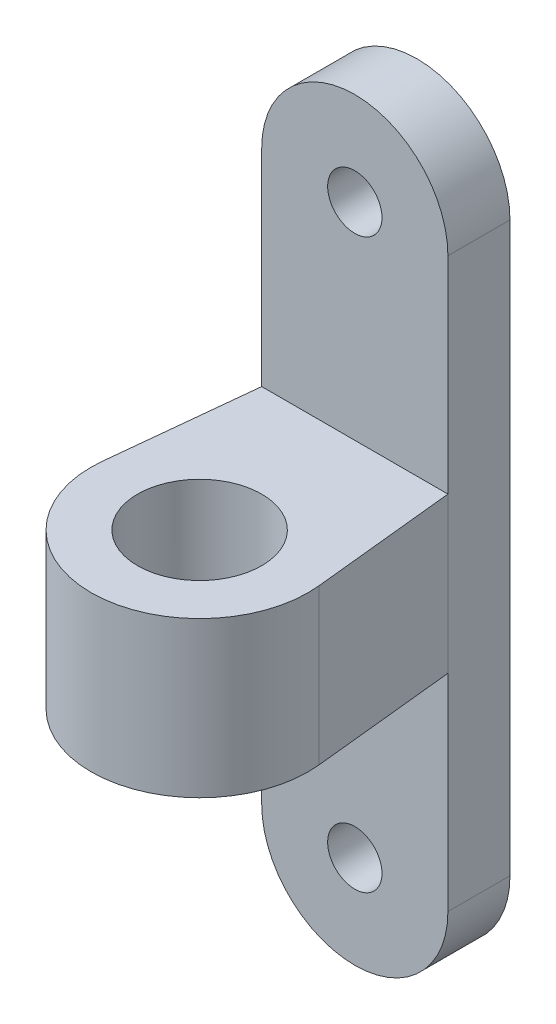
ISO-10303-21;
HEADER;
FILE_DESCRIPTION(('STEP AP214'),'2;1');
FILE_NAME('part.step','',(''),(''),'','','');
FILE_SCHEMA(('AUTOMOTIVE_DESIGN { 1 0 10303 214 1 1 1 1 }'));
ENDSEC;
DATA;
#1=APPLICATION_CONTEXT('core data for automotive mechanical design processes');
#2=APPLICATION_PROTOCOL_DEFINITION('international standard','automotive_design',2000,#1);
#3=PRODUCT_CONTEXT('',#1,'mechanical');
#4=PRODUCT('Part','Part','',(#3));
#5=PRODUCT_RELATED_PRODUCT_CATEGORY('part','',(#4));
#6=PRODUCT_DEFINITION_FORMATION('','',#4);
#7=PRODUCT_DEFINITION_CONTEXT('part definition',#1,'design');
#8=PRODUCT_DEFINITION('design','',#6,#7);
#9=PRODUCT_DEFINITION_SHAPE('','',#8);
#10=(LENGTH_UNIT() NAMED_UNIT(*) SI_UNIT(.MILLI.,.METRE.));
#11=(NAMED_UNIT(*) PLANE_ANGLE_UNIT() SI_UNIT($,.RADIAN.));
#12=(NAMED_UNIT(*) SI_UNIT($,.STERADIAN.) SOLID_ANGLE_UNIT());
#13=UNCERTAINTY_MEASURE_WITH_UNIT(LENGTH_MEASURE(1.E-05),#10,'distance_accuracy_value','');
#14=(GEOMETRIC_REPRESENTATION_CONTEXT(3) GLOBAL_UNCERTAINTY_ASSIGNED_CONTEXT((#13)) GLOBAL_UNIT_ASSIGNED_CONTEXT((#10,
#11,#12)) REPRESENTATION_CONTEXT('',''));
#15=CARTESIAN_POINT('',(0.,0.,0.));
#16=DIRECTION('',(0.,0.,1.));
#17=DIRECTION('',(1.,0.,0.));
#18=AXIS2_PLACEMENT_3D('',#15,#16,#17);
#19=CARTESIAN_POINT('',(0.,0.,4.));
#20=DIRECTION('',(0.,0.,1.));
#21=DIRECTION('',(1.,0.,0.));
#22=AXIS2_PLACEMENT_3D('',#19,#20,#21);
#23=PLANE('',#22);
#24=DIRECTION('',(-1.,0.,0.));
#25=VECTOR('',#24,1.);
#26=CARTESIAN_POINT('',(0.,23.3,4.));
#27=LINE('',#26,#25);
#28=CARTESIAN_POINT('',(6.,23.3,4.));
#29=VERTEX_POINT('',#28);
#30=CARTESIAN_POINT('',(-6.,23.3,4.));
#31=VERTEX_POINT('',#30);
#32=EDGE_CURVE('E163',#29,#31,#27,.T.);
#33=ORIENTED_EDGE('',*,*,#32,.F.);
#34=DIRECTION('',(0.,1.,0.));
#35=VECTOR('',#34,1.);
#36=CARTESIAN_POINT('',(6.,0.,4.));
#37=LINE('',#36,#35);
#38=CARTESIAN_POINT('',(6.,36.6,4.));
#39=VERTEX_POINT('',#38);
#40=EDGE_CURVE('E191',#29,#39,#37,.T.);
#41=ORIENTED_EDGE('',*,*,#40,.T.);
#42=CARTESIAN_POINT('',(0.,36.6,4.));
#43=DIRECTION('',(0.,0.,1.));
#44=DIRECTION('',(1.,0.,0.));
#45=AXIS2_PLACEMENT_3D('',#42,#43,#44);
#46=CIRCLE('',#45,6.);
#47=CARTESIAN_POINT('',(-6.,36.6,4.));
#48=VERTEX_POINT('',#47);
#49=EDGE_CURVE('E193',#39,#48,#46,.T.);
#50=ORIENTED_EDGE('',*,*,#49,.T.);
#51=DIRECTION('',(0.,-1.,0.));
#52=VECTOR('',#51,1.);
#53=CARTESIAN_POINT('',(-6.,0.,4.));
#54=LINE('',#53,#52);
#55=EDGE_CURVE('E195',#48,#31,#54,.T.);
#56=ORIENTED_EDGE('',*,*,#55,.T.);
#57=EDGE_LOOP('',(#33,#41,#50,#56));
#58=FACE_BOUND('',#57,.T.);
#59=CARTESIAN_POINT('',(0.,36.6,4.));
#60=DIRECTION('',(0.,0.,1.));
#61=DIRECTION('',(1.,0.,0.));
#62=AXIS2_PLACEMENT_3D('',#59,#60,#61);
#63=CIRCLE('',#62,1.75);
#64=CARTESIAN_POINT('',(1.75,36.6,4.));
#65=VERTEX_POINT('',#64);
#66=EDGE_CURVE('E177',#65,#65,#63,.T.);
#67=ORIENTED_EDGE('',*,*,#66,.F.);
#68=EDGE_LOOP('',(#67));
#69=FACE_BOUND('',#68,.T.);
#70=ADVANCED_FACE('F65',(#58,#69),#23,.T.);
#71=DIRECTION('',(1.,0.,0.));
#72=VECTOR('',#71,1.);
#73=CARTESIAN_POINT('',(0.,13.3,4.));
#74=LINE('',#73,#72);
#75=CARTESIAN_POINT('',(-6.,13.3,4.));
#76=VERTEX_POINT('',#75);
#77=CARTESIAN_POINT('',(6.,13.3,4.));
#78=VERTEX_POINT('',#77);
#79=EDGE_CURVE('E169',#76,#78,#74,.T.);
#80=ORIENTED_EDGE('',*,*,#79,.F.);
#81=CARTESIAN_POINT('',(-6.,0.,4.));
#82=VERTEX_POINT('',#81);
#83=EDGE_CURVE('E90',#76,#82,#54,.T.);
#84=ORIENTED_EDGE('',*,*,#83,.T.);
#85=CARTESIAN_POINT('',(0.,0.,4.));
#86=DIRECTION('',(0.,0.,1.));
#87=DIRECTION('',(1.,0.,0.));
#88=AXIS2_PLACEMENT_3D('',#85,#86,#87);
#89=CIRCLE('',#88,6.);
#90=CARTESIAN_POINT('',(6.,0.,4.));
#91=VERTEX_POINT('',#90);
#92=EDGE_CURVE('E189',#82,#91,#89,.T.);
#93=ORIENTED_EDGE('',*,*,#92,.T.);
#94=EDGE_CURVE('E120',#91,#78,#37,.T.);
#95=ORIENTED_EDGE('',*,*,#94,.T.);
#96=EDGE_LOOP('',(#80,#84,#93,#95));
#97=FACE_BOUND('',#96,.T.);
#98=CARTESIAN_POINT('',(0.,0.,4.));
#99=DIRECTION('',(0.,0.,1.));
#100=DIRECTION('',(1.,0.,0.));
#101=AXIS2_PLACEMENT_3D('',#98,#99,#100);
#102=CIRCLE('',#101,1.75);
#103=CARTESIAN_POINT('',(1.75,0.,4.));
#104=VERTEX_POINT('',#103);
#105=EDGE_CURVE('E183',#104,#104,#102,.T.);
#106=ORIENTED_EDGE('',*,*,#105,.F.);
#107=EDGE_LOOP('',(#106));
#108=FACE_BOUND('',#107,.T.);
#109=ADVANCED_FACE('F235',(#97,#108),#23,.T.);
#110=CARTESIAN_POINT('',(0.,0.,0.));
#111=DIRECTION('',(0.,0.,1.));
#112=DIRECTION('',(1.,0.,0.));
#113=AXIS2_PLACEMENT_3D('',#110,#111,#112);
#114=PLANE('',#113);
#115=CARTESIAN_POINT('',(0.,36.6,0.));
#116=DIRECTION('',(0.,0.,1.));
#117=DIRECTION('',(1.,0.,0.));
#118=AXIS2_PLACEMENT_3D('',#115,#116,#117);
#119=CIRCLE('',#118,6.);
#120=CARTESIAN_POINT('',(6.,36.6,0.));
#121=VERTEX_POINT('',#120);
#122=CARTESIAN_POINT('',(-6.,36.6,0.));
#123=VERTEX_POINT('',#122);
#124=EDGE_CURVE('E202',#121,#123,#119,.T.);
#125=ORIENTED_EDGE('',*,*,#124,.F.);
#126=DIRECTION('',(0.,1.,0.));
#127=VECTOR('',#126,1.);
#128=CARTESIAN_POINT('',(6.,0.,0.));
#129=LINE('',#128,#127);
#130=CARTESIAN_POINT('',(6.,0.,0.));
#131=VERTEX_POINT('',#130);
#132=EDGE_CURVE('E200',#131,#121,#129,.T.);
#133=ORIENTED_EDGE('',*,*,#132,.F.);
#134=CARTESIAN_POINT('',(0.,0.,0.));
#135=DIRECTION('',(0.,0.,1.));
#136=DIRECTION('',(1.,0.,0.));
#137=AXIS2_PLACEMENT_3D('',#134,#135,#136);
#138=CIRCLE('',#137,6.);
#139=CARTESIAN_POINT('',(-6.,0.,0.));
#140=VERTEX_POINT('',#139);
#141=EDGE_CURVE('E186',#140,#131,#138,.T.);
#142=ORIENTED_EDGE('',*,*,#141,.F.);
#143=DIRECTION('',(0.,-1.,0.));
#144=VECTOR('',#143,1.);
#145=CARTESIAN_POINT('',(-6.,0.,0.));
#146=LINE('',#145,#144);
#147=EDGE_CURVE('E112',#123,#140,#146,.T.);
#148=ORIENTED_EDGE('',*,*,#147,.F.);
#149=EDGE_LOOP('',(#125,#133,#142,#148));
#150=FACE_BOUND('',#149,.T.);
#151=CARTESIAN_POINT('',(0.,0.,0.));
#152=DIRECTION('',(0.,0.,1.));
#153=DIRECTION('',(1.,0.,0.));
#154=AXIS2_PLACEMENT_3D('',#151,#152,#153);
#155=CIRCLE('',#154,1.75);
#156=CARTESIAN_POINT('',(1.75,0.,0.));
#157=VERTEX_POINT('',#156);
#158=EDGE_CURVE('E180',#157,#157,#155,.T.);
#159=ORIENTED_EDGE('',*,*,#158,.T.);
#160=EDGE_LOOP('',(#159));
#161=FACE_BOUND('',#160,.T.);
#162=CARTESIAN_POINT('',(0.,36.6,0.));
#163=DIRECTION('',(0.,0.,1.));
#164=DIRECTION('',(1.,0.,0.));
#165=AXIS2_PLACEMENT_3D('',#162,#163,#164);
#166=CIRCLE('',#165,1.75);
#167=CARTESIAN_POINT('',(1.75,36.6,0.));
#168=VERTEX_POINT('',#167);
#169=EDGE_CURVE('E176',#168,#168,#166,.T.);
#170=ORIENTED_EDGE('',*,*,#169,.T.);
#171=EDGE_LOOP('',(#170));
#172=FACE_BOUND('',#171,.T.);
#173=ADVANCED_FACE('F238',(#150,#161,#172),#114,.F.);
#174=CARTESIAN_POINT('',(0.,0.,4.));
#175=DIRECTION('',(0.,0.,-1.));
#176=DIRECTION('',(-1.,0.,0.));
#177=AXIS2_PLACEMENT_3D('',#174,#175,#176);
#178=CYLINDRICAL_SURFACE('',#177,6.);
#179=ORIENTED_EDGE('',*,*,#141,.T.);
#180=DIRECTION('',(0.,0.,-1.));
#181=VECTOR('',#180,1.);
#182=CARTESIAN_POINT('',(6.,0.,4.));
#183=LINE('',#182,#181);
#184=EDGE_CURVE('E211',#91,#131,#183,.T.);
#185=ORIENTED_EDGE('',*,*,#184,.F.);
#186=ORIENTED_EDGE('',*,*,#92,.F.);
#187=DIRECTION('',(0.,0.,-1.));
#188=VECTOR('',#187,1.);
#189=CARTESIAN_POINT('',(-6.,0.,4.));
#190=LINE('',#189,#188);
#191=EDGE_CURVE('E197',#82,#140,#190,.T.);
#192=ORIENTED_EDGE('',*,*,#191,.T.);
#193=EDGE_LOOP('',(#179,#185,#186,#192));
#194=FACE_BOUND('',#193,.T.);
#195=ADVANCED_FACE('F67',(#194),#178,.T.);
#196=CARTESIAN_POINT('',(6.,0.,4.));
#197=DIRECTION('',(-1.,0.,0.));
#198=DIRECTION('',(0.,0.,1.));
#199=AXIS2_PLACEMENT_3D('',#196,#197,#198);
#200=PLANE('',#199);
#201=ORIENTED_EDGE('',*,*,#132,.T.);
#202=DIRECTION('',(0.,0.,-1.));
#203=VECTOR('',#202,1.);
#204=CARTESIAN_POINT('',(6.,36.6,4.));
#205=LINE('',#204,#203);
#206=EDGE_CURVE('E208',#39,#121,#205,.T.);
#207=ORIENTED_EDGE('',*,*,#206,.F.);
#208=ORIENTED_EDGE('',*,*,#40,.F.);
#209=DIRECTION('',(0.,1.,0.));
#210=VECTOR('',#209,1.);
#211=CARTESIAN_POINT('',(6.,-6.,4.));
#212=LINE('',#211,#210);
#213=EDGE_CURVE('E170',#78,#29,#212,.T.);
#214=ORIENTED_EDGE('',*,*,#213,.F.);
#215=ORIENTED_EDGE('',*,*,#94,.F.);
#216=ORIENTED_EDGE('',*,*,#184,.T.);
#217=EDGE_LOOP('',(#201,#207,#208,#214,#215,#216));
#218=FACE_BOUND('',#217,.T.);
#219=ADVANCED_FACE('F224',(#218),#200,.F.);
#220=CARTESIAN_POINT('',(0.,36.6,4.));
#221=DIRECTION('',(0.,0.,-1.));
#222=DIRECTION('',(-1.,0.,0.));
#223=AXIS2_PLACEMENT_3D('',#220,#221,#222);
#224=CYLINDRICAL_SURFACE('',#223,6.);
#225=ORIENTED_EDGE('',*,*,#124,.T.);
#226=DIRECTION('',(0.,0.,-1.));
#227=VECTOR('',#226,1.);
#228=CARTESIAN_POINT('',(-6.,36.6,4.));
#229=LINE('',#228,#227);
#230=EDGE_CURVE('E206',#48,#123,#229,.T.);
#231=ORIENTED_EDGE('',*,*,#230,.F.);
#232=ORIENTED_EDGE('',*,*,#49,.F.);
#233=ORIENTED_EDGE('',*,*,#206,.T.);
#234=EDGE_LOOP('',(#225,#231,#232,#233));
#235=FACE_BOUND('',#234,.T.);
#236=ADVANCED_FACE('F229',(#235),#224,.T.);
#237=CARTESIAN_POINT('',(-6.,0.,4.));
#238=DIRECTION('',(1.,0.,0.));
#239=DIRECTION('',(0.,0.,-1.));
#240=AXIS2_PLACEMENT_3D('',#237,#238,#239);
#241=PLANE('',#240);
#242=ORIENTED_EDGE('',*,*,#83,.F.);
#243=DIRECTION('',(0.,1.,0.));
#244=VECTOR('',#243,1.);
#245=CARTESIAN_POINT('',(-6.,-6.,4.));
#246=LINE('',#245,#244);
#247=EDGE_CURVE('E81',#76,#31,#246,.T.);
#248=ORIENTED_EDGE('',*,*,#247,.T.);
#249=ORIENTED_EDGE('',*,*,#55,.F.);
#250=ORIENTED_EDGE('',*,*,#230,.T.);
#251=ORIENTED_EDGE('',*,*,#147,.T.);
#252=ORIENTED_EDGE('',*,*,#191,.F.);
#253=EDGE_LOOP('',(#242,#248,#249,#250,#251,#252));
#254=FACE_BOUND('',#253,.T.);
#255=ADVANCED_FACE('F230',(#254),#241,.F.);
#256=CARTESIAN_POINT('',(0.,0.,4.));
#257=DIRECTION('',(0.,0.,-1.));
#258=DIRECTION('',(-1.,0.,0.));
#259=AXIS2_PLACEMENT_3D('',#256,#257,#258);
#260=CYLINDRICAL_SURFACE('',#259,1.75);
#261=ORIENTED_EDGE('',*,*,#105,.T.);
#262=EDGE_LOOP('',(#261));
#263=FACE_BOUND('',#262,.T.);
#264=ORIENTED_EDGE('',*,*,#158,.F.);
#265=EDGE_LOOP('',(#264));
#266=FACE_BOUND('',#265,.T.);
#267=ADVANCED_FACE('F242',(#263,#266),#260,.F.);
#268=CARTESIAN_POINT('',(0.,36.6,4.));
#269=DIRECTION('',(0.,0.,-1.));
#270=DIRECTION('',(-1.,0.,0.));
#271=AXIS2_PLACEMENT_3D('',#268,#269,#270);
#272=CYLINDRICAL_SURFACE('',#271,1.75);
#273=ORIENTED_EDGE('',*,*,#66,.T.);
#274=EDGE_LOOP('',(#273));
#275=FACE_BOUND('',#274,.T.);
#276=ORIENTED_EDGE('',*,*,#169,.F.);
#277=EDGE_LOOP('',(#276));
#278=FACE_BOUND('',#277,.T.);
#279=ADVANCED_FACE('F245',(#275,#278),#272,.F.);
#280=CARTESIAN_POINT('',(-16.4835814662463,23.3,25.));
#281=DIRECTION('',(0.,1.,0.));
#282=DIRECTION('',(-1.,0.,0.));
#283=AXIS2_PLACEMENT_3D('',#280,#281,#282);
#284=PLANE('',#283);
#285=CARTESIAN_POINT('',(0.,23.3,14.));
#286=DIRECTION('',(0.,1.,0.));
#287=DIRECTION('',(0.,0.,1.));
#288=AXIS2_PLACEMENT_3D('',#285,#286,#287);
#289=CIRCLE('',#288,4.);
#290=CARTESIAN_POINT('',(0.,23.3,18.));
#291=VERTEX_POINT('',#290);
#292=EDGE_CURVE('E375',#291,#291,#289,.F.);
#293=ORIENTED_EDGE('',*,*,#292,.T.);
#294=EDGE_LOOP('',(#293));
#295=FACE_BOUND('',#294,.T.);
#296=DIRECTION('',(0.103203865304905,0.,0.994660224491825));
#297=VECTOR('',#296,1.);
#298=CARTESIAN_POINT('',(5.52548265378636,23.3,-0.573312527740115));
#299=LINE('',#298,#297);
#300=CARTESIAN_POINT('',(6.96262157144278,23.3,13.2775729428657));
#301=VERTEX_POINT('',#300);
#302=EDGE_CURVE('E149',#29,#301,#299,.T.);
#303=ORIENTED_EDGE('',*,*,#302,.F.);
#304=ORIENTED_EDGE('',*,*,#32,.T.);
#305=DIRECTION('',(-0.103203865304905,0.,0.994660224491825));
#306=VECTOR('',#305,1.);
#307=CARTESIAN_POINT('',(-5.52548265378636,23.3,-0.573312527740115));
#308=LINE('',#307,#306);
#309=CARTESIAN_POINT('',(-6.96262157144277,23.3,13.2775729428657));
#310=VERTEX_POINT('',#309);
#311=EDGE_CURVE('E144',#31,#310,#308,.T.);
#312=ORIENTED_EDGE('',*,*,#311,.T.);
#313=CARTESIAN_POINT('',(0.,23.3,14.));
#314=DIRECTION('',(0.,1.,0.));
#315=DIRECTION('',(0.,0.,1.));
#316=AXIS2_PLACEMENT_3D('',#313,#314,#315);
#317=CIRCLE('',#316,7.);
#318=EDGE_CURVE('E152',#310,#301,#317,.T.);
#319=ORIENTED_EDGE('',*,*,#318,.T.);
#320=EDGE_LOOP('',(#303,#304,#312,#319));
#321=FACE_BOUND('',#320,.T.);
#322=ADVANCED_FACE('F161',(#295,#321),#284,.T.);
#323=CARTESIAN_POINT('',(-16.4835814662463,13.3,25.));
#324=DIRECTION('',(0.,-1.,0.));
#325=DIRECTION('',(1.,0.,0.));
#326=AXIS2_PLACEMENT_3D('',#323,#324,#325);
#327=PLANE('',#326);
#328=CARTESIAN_POINT('',(0.,13.3,14.));
#329=DIRECTION('',(0.,-1.,0.));
#330=DIRECTION('',(1.,0.,0.));
#331=AXIS2_PLACEMENT_3D('',#328,#329,#330);
#332=CIRCLE('',#331,4.);
#333=CARTESIAN_POINT('',(4.00000000000001,13.3,14.));
#334=VERTEX_POINT('',#333);
#335=EDGE_CURVE('E69',#334,#334,#332,.F.);
#336=ORIENTED_EDGE('',*,*,#335,.T.);
#337=EDGE_LOOP('',(#336));
#338=FACE_BOUND('',#337,.T.);
#339=DIRECTION('',(-0.103203865304905,0.,-0.994660224491825));
#340=VECTOR('',#339,1.);
#341=CARTESIAN_POINT('',(7.91623490009634,13.3,22.4683260678057));
#342=LINE('',#341,#340);
#343=CARTESIAN_POINT('',(6.96262157144278,13.3,13.2775729428657));
#344=VERTEX_POINT('',#343);
#345=EDGE_CURVE('E12',#344,#78,#342,.T.);
#346=ORIENTED_EDGE('',*,*,#345,.F.);
#347=CARTESIAN_POINT('',(0.,13.3,14.));
#348=DIRECTION('',(0.,-1.,0.));
#349=DIRECTION('',(1.,0.,0.));
#350=AXIS2_PLACEMENT_3D('',#347,#348,#349);
#351=CIRCLE('',#350,7.);
#352=CARTESIAN_POINT('',(-6.96262157144277,13.3,13.2775729428657));
#353=VERTEX_POINT('',#352);
#354=EDGE_CURVE('E74',#344,#353,#351,.T.);
#355=ORIENTED_EDGE('',*,*,#354,.T.);
#356=DIRECTION('',(0.103203865304905,0.,-0.994660224491825));
#357=VECTOR('',#356,1.);
#358=CARTESIAN_POINT('',(-8.26736939910643,13.3,25.8524969860204));
#359=LINE('',#358,#357);
#360=EDGE_CURVE('E146',#353,#76,#359,.T.);
#361=ORIENTED_EDGE('',*,*,#360,.T.);
#362=ORIENTED_EDGE('',*,*,#79,.T.);
#363=EDGE_LOOP('',(#346,#355,#361,#362));
#364=FACE_BOUND('',#363,.T.);
#365=ADVANCED_FACE('F216',(#338,#364),#327,.T.);
#366=CARTESIAN_POINT('',(0.,-6.,14.));
#367=DIRECTION('',(0.,1.,0.));
#368=DIRECTION('',(0.,0.,1.));
#369=AXIS2_PLACEMENT_3D('',#366,#367,#368);
#370=CYLINDRICAL_SURFACE('',#369,7.);
#371=DIRECTION('',(0.,1.,0.));
#372=VECTOR('',#371,1.);
#373=CARTESIAN_POINT('',(6.96262157144278,-6.,13.2775729428657));
#374=LINE('',#373,#372);
#375=EDGE_CURVE('E155',#344,#301,#374,.T.);
#376=ORIENTED_EDGE('',*,*,#375,.T.);
#377=ORIENTED_EDGE('',*,*,#318,.F.);
#378=DIRECTION('',(0.,1.,0.));
#379=VECTOR('',#378,1.);
#380=CARTESIAN_POINT('',(-6.96262157144277,-6.,13.2775729428657));
#381=LINE('',#380,#379);
#382=EDGE_CURVE('E140',#353,#310,#381,.T.);
#383=ORIENTED_EDGE('',*,*,#382,.F.);
#384=ORIENTED_EDGE('',*,*,#354,.F.);
#385=EDGE_LOOP('',(#376,#377,#383,#384));
#386=FACE_BOUND('',#385,.T.);
#387=ADVANCED_FACE('F153',(#386),#370,.T.);
#388=CARTESIAN_POINT('',(5.52548265378636,-6.,-0.573312527740115));
#389=DIRECTION('',(-0.994660224491825,0.,0.103203865304905));
#390=DIRECTION('',(0.103203865304905,0.,0.994660224491825));
#391=AXIS2_PLACEMENT_3D('',#388,#389,#390);
#392=PLANE('',#391);
#393=ORIENTED_EDGE('',*,*,#345,.T.);
#394=ORIENTED_EDGE('',*,*,#213,.T.);
#395=ORIENTED_EDGE('',*,*,#302,.T.);
#396=ORIENTED_EDGE('',*,*,#375,.F.);
#397=EDGE_LOOP('',(#393,#394,#395,#396));
#398=FACE_BOUND('',#397,.T.);
#399=ADVANCED_FACE('F218',(#398),#392,.F.);
#400=CARTESIAN_POINT('',(-5.52548265378636,-6.,-0.573312527740115));
#401=DIRECTION('',(-0.994660224491825,0.,-0.103203865304905));
#402=DIRECTION('',(-0.103203865304905,0.,0.994660224491825));
#403=AXIS2_PLACEMENT_3D('',#400,#401,#402);
#404=PLANE('',#403);
#405=ORIENTED_EDGE('',*,*,#382,.T.);
#406=ORIENTED_EDGE('',*,*,#311,.F.);
#407=ORIENTED_EDGE('',*,*,#247,.F.);
#408=ORIENTED_EDGE('',*,*,#360,.F.);
#409=EDGE_LOOP('',(#405,#406,#407,#408));
#410=FACE_BOUND('',#409,.T.);
#411=ADVANCED_FACE('F142',(#410),#404,.T.);
#412=CARTESIAN_POINT('',(0.,-6.,14.));
#413=DIRECTION('',(0.,1.,0.));
#414=DIRECTION('',(0.,0.,1.));
#415=AXIS2_PLACEMENT_3D('',#412,#413,#414);
#416=CYLINDRICAL_SURFACE('',#415,4.);
#417=ORIENTED_EDGE('',*,*,#335,.F.);
#418=EDGE_LOOP('',(#417));
#419=FACE_BOUND('',#418,.T.);
#420=ORIENTED_EDGE('',*,*,#292,.F.);
#421=EDGE_LOOP('',(#420));
#422=FACE_BOUND('',#421,.T.);
#423=ADVANCED_FACE('F357',(#419,#422),#416,.F.);
#424=CLOSED_SHELL('',(#70,#109,#173,#195,#219,#236,#255,#267,#279,#322,#365,#387,#399,#411,#423));
#425=MANIFOLD_SOLID_BREP('B2',#424);
#426=ADVANCED_BREP_SHAPE_REPRESENTATION('',(#18,#425),#14);
#427=SHAPE_DEFINITION_REPRESENTATION(#9,#426);
ENDSEC;
END-ISO-10303-21;
